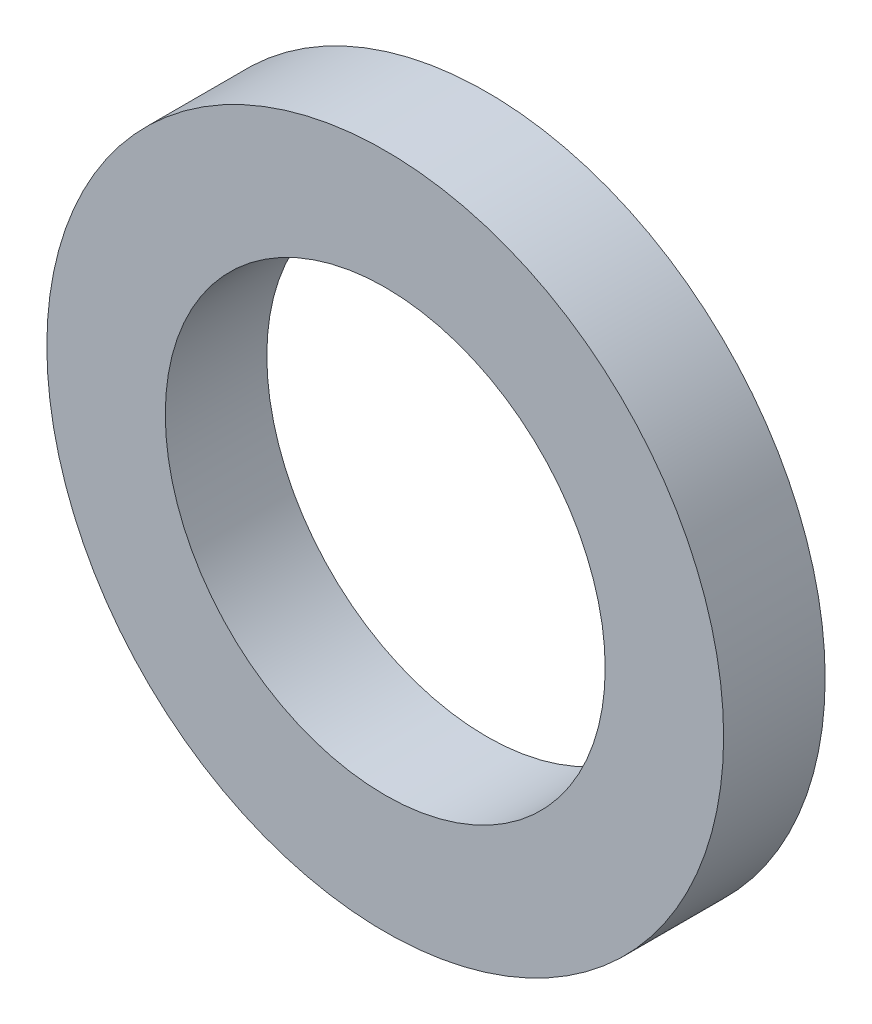
ISO-10303-21;
HEADER;
FILE_DESCRIPTION(('STEP AP214'),'2;1');
FILE_NAME('part.step','',(''),(''),'','','');
FILE_SCHEMA(('AUTOMOTIVE_DESIGN { 1 0 10303 214 1 1 1 1 }'));
ENDSEC;
DATA;
#1=APPLICATION_CONTEXT('core data for automotive mechanical design processes');
#2=APPLICATION_PROTOCOL_DEFINITION('international standard','automotive_design',2000,#1);
#3=PRODUCT_CONTEXT('',#1,'mechanical');
#4=PRODUCT('Part','Part','',(#3));
#5=PRODUCT_RELATED_PRODUCT_CATEGORY('part','',(#4));
#6=PRODUCT_DEFINITION_FORMATION('','',#4);
#7=PRODUCT_DEFINITION_CONTEXT('part definition',#1,'design');
#8=PRODUCT_DEFINITION('design','',#6,#7);
#9=PRODUCT_DEFINITION_SHAPE('','',#8);
#10=(LENGTH_UNIT() NAMED_UNIT(*) SI_UNIT(.MILLI.,.METRE.));
#11=(NAMED_UNIT(*) PLANE_ANGLE_UNIT() SI_UNIT($,.RADIAN.));
#12=(NAMED_UNIT(*) SI_UNIT($,.STERADIAN.) SOLID_ANGLE_UNIT());
#13=UNCERTAINTY_MEASURE_WITH_UNIT(LENGTH_MEASURE(1.E-05),#10,'distance_accuracy_value','');
#14=(GEOMETRIC_REPRESENTATION_CONTEXT(3) GLOBAL_UNCERTAINTY_ASSIGNED_CONTEXT((#13)) GLOBAL_UNIT_ASSIGNED_CONTEXT((#10,
#11,#12)) REPRESENTATION_CONTEXT('',''));
#15=CARTESIAN_POINT('',(0.,0.,0.));
#16=DIRECTION('',(0.,0.,1.));
#17=DIRECTION('',(1.,0.,0.));
#18=AXIS2_PLACEMENT_3D('',#15,#16,#17);
#19=CARTESIAN_POINT('',(0.,0.,0.));
#20=DIRECTION('',(0.,0.,1.));
#21=DIRECTION('',(1.,0.,0.));
#22=AXIS2_PLACEMENT_3D('',#19,#20,#21);
#23=PLANE('',#22);
#24=CARTESIAN_POINT('',(0.,0.,0.));
#25=DIRECTION('',(0.,0.,-1.));
#26=DIRECTION('',(-1.,0.,0.));
#27=AXIS2_PLACEMENT_3D('',#24,#25,#26);
#28=CIRCLE('',#27,6.5);
#29=CARTESIAN_POINT('',(-6.5,0.,0.));
#30=VERTEX_POINT('',#29);
#31=EDGE_CURVE('E30',#30,#30,#28,.F.);
#32=ORIENTED_EDGE('',*,*,#31,.T.);
#33=EDGE_LOOP('',(#32));
#34=FACE_BOUND('',#33,.T.);
#35=CARTESIAN_POINT('',(0.,0.,0.));
#36=DIRECTION('',(0.,0.,-1.));
#37=DIRECTION('',(-1.,0.,0.));
#38=AXIS2_PLACEMENT_3D('',#35,#36,#37);
#39=CIRCLE('',#38,10.);
#40=CARTESIAN_POINT('',(-10.,0.,0.));
#41=VERTEX_POINT('',#40);
#42=EDGE_CURVE('E18',#41,#41,#39,.F.);
#43=ORIENTED_EDGE('',*,*,#42,.F.);
#44=EDGE_LOOP('',(#43));
#45=FACE_BOUND('',#44,.T.);
#46=ADVANCED_FACE('F15',(#34,#45),#23,.F.);
#47=CARTESIAN_POINT('',(0.,0.,3.));
#48=DIRECTION('',(0.,0.,-1.));
#49=DIRECTION('',(-1.,0.,0.));
#50=AXIS2_PLACEMENT_3D('',#47,#48,#49);
#51=CYLINDRICAL_SURFACE('',#50,10.);
#52=ORIENTED_EDGE('',*,*,#42,.T.);
#53=EDGE_LOOP('',(#52));
#54=FACE_BOUND('',#53,.T.);
#55=CARTESIAN_POINT('',(0.,0.,3.));
#56=DIRECTION('',(0.,0.,-1.));
#57=DIRECTION('',(-1.,0.,0.));
#58=AXIS2_PLACEMENT_3D('',#55,#56,#57);
#59=CIRCLE('',#58,10.);
#60=CARTESIAN_POINT('',(-10.,0.,3.));
#61=VERTEX_POINT('',#60);
#62=EDGE_CURVE('E23',#61,#61,#59,.F.);
#63=ORIENTED_EDGE('',*,*,#62,.F.);
#64=EDGE_LOOP('',(#63));
#65=FACE_BOUND('',#64,.T.);
#66=ADVANCED_FACE('F40',(#54,#65),#51,.T.);
#67=CARTESIAN_POINT('',(0.,0.,3.));
#68=DIRECTION('',(0.,0.,-1.));
#69=DIRECTION('',(-1.,0.,0.));
#70=AXIS2_PLACEMENT_3D('',#67,#68,#69);
#71=CYLINDRICAL_SURFACE('',#70,6.5);
#72=CARTESIAN_POINT('',(0.,0.,3.));
#73=DIRECTION('',(0.,0.,-1.));
#74=DIRECTION('',(-1.,0.,0.));
#75=AXIS2_PLACEMENT_3D('',#72,#73,#74);
#76=CIRCLE('',#75,6.5);
#77=CARTESIAN_POINT('',(-6.5,0.,3.));
#78=VERTEX_POINT('',#77);
#79=EDGE_CURVE('E10',#78,#78,#76,.T.);
#80=ORIENTED_EDGE('',*,*,#79,.F.);
#81=EDGE_LOOP('',(#80));
#82=FACE_BOUND('',#81,.T.);
#83=ORIENTED_EDGE('',*,*,#31,.F.);
#84=EDGE_LOOP('',(#83));
#85=FACE_BOUND('',#84,.T.);
#86=ADVANCED_FACE('F48',(#82,#85),#71,.F.);
#87=CARTESIAN_POINT('',(0.,0.,3.));
#88=DIRECTION('',(0.,0.,1.));
#89=DIRECTION('',(1.,0.,0.));
#90=AXIS2_PLACEMENT_3D('',#87,#88,#89);
#91=PLANE('',#90);
#92=ORIENTED_EDGE('',*,*,#79,.T.);
#93=EDGE_LOOP('',(#92));
#94=FACE_BOUND('',#93,.T.);
#95=ORIENTED_EDGE('',*,*,#62,.T.);
#96=EDGE_LOOP('',(#95));
#97=FACE_BOUND('',#96,.T.);
#98=ADVANCED_FACE('F49',(#94,#97),#91,.T.);
#99=CLOSED_SHELL('',(#46,#66,#86,#98));
#100=MANIFOLD_SOLID_BREP('B1',#99);
#101=ADVANCED_BREP_SHAPE_REPRESENTATION('',(#18,#100),#14);
#102=SHAPE_DEFINITION_REPRESENTATION(#9,#101);
ENDSEC;
END-ISO-10303-21;
